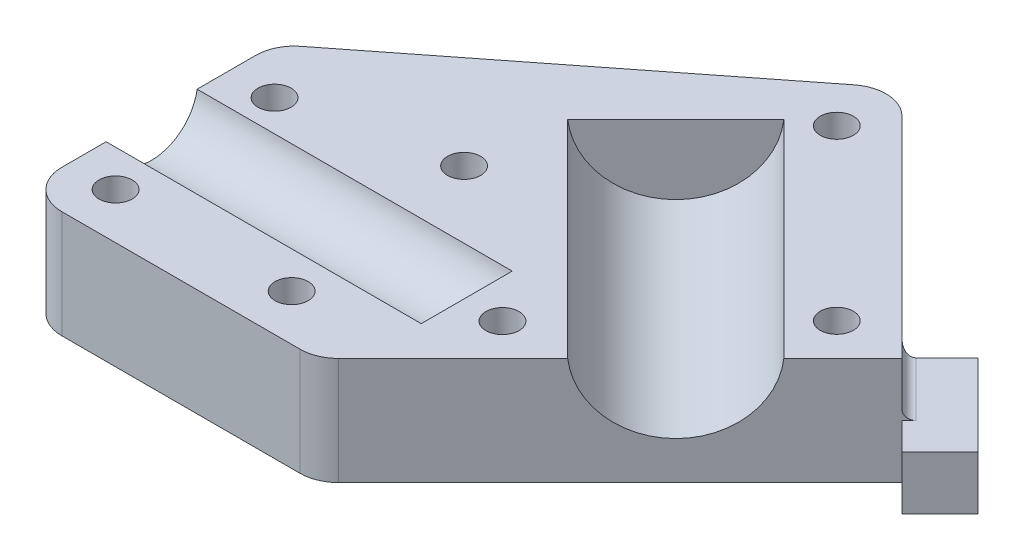
ISO-10303-21;
HEADER;
FILE_DESCRIPTION(('STEP AP214'),'2;1');
FILE_NAME('part.step','',(''),(''),'','','');
FILE_SCHEMA(('AUTOMOTIVE_DESIGN { 1 0 10303 214 1 1 1 1 }'));
ENDSEC;
DATA;
#1=APPLICATION_CONTEXT('core data for automotive mechanical design processes');
#2=APPLICATION_PROTOCOL_DEFINITION('international standard','automotive_design',2000,#1);
#3=PRODUCT_CONTEXT('',#1,'mechanical');
#4=PRODUCT('Part','Part','',(#3));
#5=PRODUCT_RELATED_PRODUCT_CATEGORY('part','',(#4));
#6=PRODUCT_DEFINITION_FORMATION('','',#4);
#7=PRODUCT_DEFINITION_CONTEXT('part definition',#1,'design');
#8=PRODUCT_DEFINITION('design','',#6,#7);
#9=PRODUCT_DEFINITION_SHAPE('','',#8);
#10=(LENGTH_UNIT() NAMED_UNIT(*) SI_UNIT(.MILLI.,.METRE.));
#11=(NAMED_UNIT(*) PLANE_ANGLE_UNIT() SI_UNIT($,.RADIAN.));
#12=(NAMED_UNIT(*) SI_UNIT($,.STERADIAN.) SOLID_ANGLE_UNIT());
#13=UNCERTAINTY_MEASURE_WITH_UNIT(LENGTH_MEASURE(1.E-05),#10,'distance_accuracy_value','');
#14=(GEOMETRIC_REPRESENTATION_CONTEXT(3) GLOBAL_UNCERTAINTY_ASSIGNED_CONTEXT((#13)) GLOBAL_UNIT_ASSIGNED_CONTEXT((#10,
#11,#12)) REPRESENTATION_CONTEXT('',''));
#15=CARTESIAN_POINT('',(0.,0.,0.));
#16=DIRECTION('',(0.,0.,1.));
#17=DIRECTION('',(1.,0.,0.));
#18=AXIS2_PLACEMENT_3D('',#15,#16,#17);
#19=CARTESIAN_POINT('',(-41.0289321881345,-1.,-16.3499999999999));
#20=DIRECTION('',(-0.617406762156341,0.,-0.78664406820596));
#21=DIRECTION('',(-0.78664406820596,0.,0.617406762156341));
#22=AXIS2_PLACEMENT_3D('',#19,#20,#21);
#23=PLANE('',#22);
#24=DIRECTION('',(0.78664406820596,0.,-0.617406762156341));
#25=VECTOR('',#24,1.);
#26=CARTESIAN_POINT('',(-41.0289321881345,-15.,-16.3499999999999));
#27=LINE('',#26,#25);
#28=CARTESIAN_POINT('',(-39.1159659989162,-15.,-17.8514138016617));
#29=VERTEX_POINT('',#28);
#30=CARTESIAN_POINT('',(1.25585463277242,-15.,-49.5377075983135));
#31=VERTEX_POINT('',#30);
#32=EDGE_CURVE('E264',#29,#31,#27,.T.);
#33=ORIENTED_EDGE('',*,*,#32,.F.);
#34=DIRECTION('',(0.,-1.,0.));
#35=VECTOR('',#34,1.);
#36=CARTESIAN_POINT('',(-39.1159659989162,-1.,-17.8514138016617));
#37=LINE('',#36,#35);
#38=CARTESIAN_POINT('',(-39.1159659989162,-1.,-17.8514138016617));
#39=VERTEX_POINT('',#38);
#40=EDGE_CURVE('E351',#29,#39,#37,.F.);
#41=ORIENTED_EDGE('',*,*,#40,.T.);
#42=DIRECTION('',(0.78664406820596,0.,-0.617406762156341));
#43=VECTOR('',#42,1.);
#44=CARTESIAN_POINT('',(-41.0289321881345,-1.,-16.3499999999999));
#45=LINE('',#44,#43);
#46=CARTESIAN_POINT('',(1.25585463277242,-1.,-49.5377075983135));
#47=VERTEX_POINT('',#46);
#48=EDGE_CURVE('E265',#39,#47,#45,.T.);
#49=ORIENTED_EDGE('',*,*,#48,.T.);
#50=DIRECTION('',(0.,-1.,0.));
#51=VECTOR('',#50,1.);
#52=CARTESIAN_POINT('',(1.25585463277243,-1.,-49.5377075983135));
#53=LINE('',#52,#51);
#54=EDGE_CURVE('E347',#47,#31,#53,.T.);
#55=ORIENTED_EDGE('',*,*,#54,.T.);
#56=EDGE_LOOP('',(#33,#41,#49,#55));
#57=FACE_BOUND('',#56,.T.);
#58=ADVANCED_FACE('F39',(#57),#23,.T.);
#59=CARTESIAN_POINT('',(-41.0289321881345,-1.,16.35));
#60=DIRECTION('',(-1.,0.,0.));
#61=DIRECTION('',(0.,0.,1.));
#62=AXIS2_PLACEMENT_3D('',#59,#60,#61);
#63=PLANE('',#62);
#64=DIRECTION('',(0.,0.,-1.));
#65=VECTOR('',#64,1.);
#66=CARTESIAN_POINT('',(-41.0289321881345,-15.,16.35));
#67=LINE('',#66,#65);
#68=CARTESIAN_POINT('',(-41.0289321881345,-15.,11.35));
#69=VERTEX_POINT('',#68);
#70=CARTESIAN_POINT('',(-41.0289321881345,-15.,-13.9181934606319));
#71=VERTEX_POINT('',#70);
#72=EDGE_CURVE('E270',#69,#71,#67,.T.);
#73=ORIENTED_EDGE('',*,*,#72,.F.);
#74=DIRECTION('',(0.,-1.,0.));
#75=VECTOR('',#74,1.);
#76=CARTESIAN_POINT('',(-41.0289321881345,-1.,11.35));
#77=LINE('',#76,#75);
#78=CARTESIAN_POINT('',(-41.0289321881345,-1.,11.35));
#79=VERTEX_POINT('',#78);
#80=EDGE_CURVE('E328',#69,#79,#77,.F.);
#81=ORIENTED_EDGE('',*,*,#80,.T.);
#82=DIRECTION('',(0.,0.,-1.));
#83=VECTOR('',#82,1.);
#84=CARTESIAN_POINT('',(-41.0289321881345,-1.,16.35));
#85=LINE('',#84,#83);
#86=CARTESIAN_POINT('',(-41.0289321881345,-0.999999999999999,5.57950001493335));
#87=VERTEX_POINT('',#86);
#88=EDGE_CURVE('E282',#79,#87,#85,.T.);
#89=ORIENTED_EDGE('',*,*,#88,.T.);
#90=CARTESIAN_POINT('',(-41.0289321881345,-0.0551181102362147,-0.345632744287866));
#91=DIRECTION('',(-1.,0.,0.));
#92=DIRECTION('',(0.,0.,1.));
#93=AXIS2_PLACEMENT_3D('',#90,#91,#92);
#94=CIRCLE('',#93,6.);
#95=CARTESIAN_POINT('',(-41.0289321881345,-1.,-6.27076550350908));
#96=VERTEX_POINT('',#95);
#97=EDGE_CURVE('E197',#96,#87,#94,.T.);
#98=ORIENTED_EDGE('',*,*,#97,.F.);
#99=CARTESIAN_POINT('',(-41.0289321881345,-1.,-13.9181934606319));
#100=VERTEX_POINT('',#99);
#101=EDGE_CURVE('E281',#96,#100,#85,.T.);
#102=ORIENTED_EDGE('',*,*,#101,.T.);
#103=DIRECTION('',(0.,-1.,0.));
#104=VECTOR('',#103,1.);
#105=CARTESIAN_POINT('',(-41.0289321881345,-1.,-13.9181934606319));
#106=LINE('',#105,#104);
#107=EDGE_CURVE('E324',#100,#71,#106,.T.);
#108=ORIENTED_EDGE('',*,*,#107,.T.);
#109=EDGE_LOOP('',(#73,#81,#89,#98,#102,#108));
#110=FACE_BOUND('',#109,.T.);
#111=ADVANCED_FACE('F398',(#110),#63,.T.);
#112=CARTESIAN_POINT('',(-2.92893218813456,-1.,16.35));
#113=DIRECTION('',(0.,0.,1.));
#114=DIRECTION('',(1.,0.,0.));
#115=AXIS2_PLACEMENT_3D('',#112,#113,#114);
#116=PLANE('',#115);
#117=DIRECTION('',(-1.,0.,0.));
#118=VECTOR('',#117,1.);
#119=CARTESIAN_POINT('',(-2.92893218813456,-1.,16.35));
#120=LINE('',#119,#118);
#121=CARTESIAN_POINT('',(-5.00000000000003,-1.,16.35));
#122=VERTEX_POINT('',#121);
#123=CARTESIAN_POINT('',(-36.0289321881345,-1.,16.35));
#124=VERTEX_POINT('',#123);
#125=EDGE_CURVE('E277',#122,#124,#120,.T.);
#126=ORIENTED_EDGE('',*,*,#125,.T.);
#127=DIRECTION('',(0.,-1.,0.));
#128=VECTOR('',#127,1.);
#129=CARTESIAN_POINT('',(-36.0289321881345,-1.,16.35));
#130=LINE('',#129,#128);
#131=CARTESIAN_POINT('',(-36.0289321881345,-15.,16.35));
#132=VERTEX_POINT('',#131);
#133=EDGE_CURVE('E308',#124,#132,#130,.T.);
#134=ORIENTED_EDGE('',*,*,#133,.T.);
#135=DIRECTION('',(-1.,0.,0.));
#136=VECTOR('',#135,1.);
#137=CARTESIAN_POINT('',(-2.92893218813456,-15.,16.35));
#138=LINE('',#137,#136);
#139=CARTESIAN_POINT('',(-5.00000000000003,-15.,16.35));
#140=VERTEX_POINT('',#139);
#141=EDGE_CURVE('E296',#140,#132,#138,.T.);
#142=ORIENTED_EDGE('',*,*,#141,.F.);
#143=DIRECTION('',(0.,-1.,0.));
#144=VECTOR('',#143,1.);
#145=CARTESIAN_POINT('',(-5.00000000000003,-1.,16.35));
#146=LINE('',#145,#144);
#147=EDGE_CURVE('E305',#140,#122,#146,.F.);
#148=ORIENTED_EDGE('',*,*,#147,.T.);
#149=EDGE_LOOP('',(#126,#134,#142,#148));
#150=FACE_BOUND('',#149,.T.);
#151=ADVANCED_FACE('F389',(#150),#116,.T.);
#152=CARTESIAN_POINT('',(35.2197556622844,-1.,-21.7986878504189));
#153=DIRECTION('',(0.707106781186547,0.,0.707106781186548));
#154=DIRECTION('',(0.707106781186548,0.,-0.707106781186547));
#155=AXIS2_PLACEMENT_3D('',#152,#153,#154);
#156=PLANE('',#155);
#157=DIRECTION('',(-0.707106781186548,0.,0.707106781186547));
#158=VECTOR('',#157,1.);
#159=CARTESIAN_POINT('',(35.2197556622844,-1.,-21.7986878504189));
#160=LINE('',#159,#158);
#161=CARTESIAN_POINT('',(13.4550962518592,-1.,-0.0340284399936866));
#162=VERTEX_POINT('',#161);
#163=CARTESIAN_POINT('',(-1.46446609406729,-1.,14.8855339059327));
#164=VERTEX_POINT('',#163);
#165=EDGE_CURVE('E195',#162,#164,#160,.T.);
#166=ORIENTED_EDGE('',*,*,#165,.T.);
#167=DIRECTION('',(0.,-1.,0.));
#168=VECTOR('',#167,1.);
#169=CARTESIAN_POINT('',(-1.46446609406729,-1.,14.8855339059327));
#170=LINE('',#169,#168);
#171=CARTESIAN_POINT('',(-1.46446609406729,-15.,14.8855339059327));
#172=VERTEX_POINT('',#171);
#173=EDGE_CURVE('E343',#164,#172,#170,.T.);
#174=ORIENTED_EDGE('',*,*,#173,.T.);
#175=DIRECTION('',(-0.707106781186548,0.,0.707106781186547));
#176=VECTOR('',#175,1.);
#177=CARTESIAN_POINT('',(35.2197556622844,-15.,-21.7986878504189));
#178=LINE('',#177,#176);
#179=CARTESIAN_POINT('',(35.2197556622844,-15.,-21.7986878504189));
#180=VERTEX_POINT('',#179);
#181=EDGE_CURVE('E292',#180,#172,#178,.T.);
#182=ORIENTED_EDGE('',*,*,#181,.F.);
#183=DIRECTION('',(0.,-1.,0.));
#184=VECTOR('',#183,1.);
#185=CARTESIAN_POINT('',(35.2197556622844,-1.,-21.7986878504189));
#186=LINE('',#185,#184);
#187=CARTESIAN_POINT('',(35.2197556622844,-8.,-21.7986878504189));
#188=VERTEX_POINT('',#187);
#189=EDGE_CURVE('E254',#188,#180,#186,.T.);
#190=ORIENTED_EDGE('',*,*,#189,.F.);
#191=DIRECTION('',(-0.707106781186548,0.,0.707106781186547));
#192=VECTOR('',#191,1.);
#193=CARTESIAN_POINT('',(6.71053390593273,-8.,6.71053390593273));
#194=LINE('',#193,#192);
#195=CARTESIAN_POINT('',(36.1177812743913,-8.,-22.6967134625258));
#196=VERTEX_POINT('',#195);
#197=EDGE_CURVE('E359',#196,#188,#194,.T.);
#198=ORIENTED_EDGE('',*,*,#197,.F.);
#199=CARTESIAN_POINT('',(36.1177812743913,-6.73,-22.6967134625258));
#200=DIRECTION('',(0.707106781186547,0.,0.707106781186548));
#201=DIRECTION('',(0.707106781186548,0.,-0.707106781186547));
#202=AXIS2_PLACEMENT_3D('',#199,#200,#201);
#203=CIRCLE('',#202,1.27);
#204=CARTESIAN_POINT('',(35.2197556622844,-6.73,-21.7986878504189));
#205=VERTEX_POINT('',#204);
#206=EDGE_CURVE('E366',#196,#205,#203,.F.);
#207=ORIENTED_EDGE('',*,*,#206,.T.);
#208=DIRECTION('',(0.,-1.,0.));
#209=VECTOR('',#208,1.);
#210=CARTESIAN_POINT('',(35.2197556622844,-1.,-21.7986878504189));
#211=LINE('',#210,#209);
#212=CARTESIAN_POINT('',(35.2197556622844,-1.,-21.7986878504189));
#213=VERTEX_POINT('',#212);
#214=EDGE_CURVE('E285',#213,#205,#211,.T.);
#215=ORIENTED_EDGE('',*,*,#214,.F.);
#216=CARTESIAN_POINT('',(27.531880540861,-1.00000000000003,-14.1108127289955));
#217=VERTEX_POINT('',#216);
#218=EDGE_CURVE('E273',#213,#217,#160,.T.);
#219=ORIENTED_EDGE('',*,*,#218,.T.);
#220=CARTESIAN_POINT('',(20.4934883963601,-0.0397541770693436,-7.07242058449459));
#221=DIRECTION('',(0.707106781186547,0.,0.707106781186548));
#222=DIRECTION('',(0.707106781186548,0.,-0.707106781186547));
#223=AXIS2_PLACEMENT_3D('',#220,#221,#222);
#224=CIRCLE('',#223,10.);
#225=EDGE_CURVE('E185',#162,#217,#224,.T.);
#226=ORIENTED_EDGE('',*,*,#225,.F.);
#227=EDGE_LOOP('',(#166,#174,#182,#190,#198,#207,#215,#219,#226));
#228=FACE_BOUND('',#227,.T.);
#229=ADVANCED_FACE('F380',(#228),#156,.T.);
#230=CARTESIAN_POINT('',(4.74345339314427,-1.,-52.2749901195591));
#231=DIRECTION('',(0.707106781186548,0.,-0.707106781186547));
#232=DIRECTION('',(-0.707106781186547,0.,-0.707106781186548));
#233=AXIS2_PLACEMENT_3D('',#230,#231,#232);
#234=PLANE('',#233);
#235=DIRECTION('',(-0.707106781186547,0.,-0.707106781186548));
#236=VECTOR('',#235,1.);
#237=CARTESIAN_POINT('',(4.74345339314427,-6.73,-52.2749901195591));
#238=LINE('',#237,#236);
#239=CARTESIAN_POINT('',(27.250662238312,-6.73,-29.7677812743913));
#240=VERTEX_POINT('',#239);
#241=EDGE_CURVE('E62',#205,#240,#238,.T.);
#242=ORIENTED_EDGE('',*,*,#241,.T.);
#243=DIRECTION('',(0.,-1.,0.));
#244=VECTOR('',#243,1.);
#245=CARTESIAN_POINT('',(27.250662238312,-15.,-29.7677812743913));
#246=LINE('',#245,#244);
#247=CARTESIAN_POINT('',(27.250662238312,-15.,-29.7677812743913));
#248=VERTEX_POINT('',#247);
#249=EDGE_CURVE('E369',#240,#248,#246,.T.);
#250=ORIENTED_EDGE('',*,*,#249,.T.);
#251=DIRECTION('',(0.707106781186547,0.,0.707106781186548));
#252=VECTOR('',#251,1.);
#253=CARTESIAN_POINT('',(4.74345339314427,-15.,-52.2749901195591));
#254=LINE('',#253,#252);
#255=CARTESIAN_POINT('',(7.87842234948687,-15.,-49.1400211632165));
#256=VERTEX_POINT('',#255);
#257=EDGE_CURVE('E289',#256,#248,#254,.T.);
#258=ORIENTED_EDGE('',*,*,#257,.F.);
#259=DIRECTION('',(0.,-1.,0.));
#260=VECTOR('',#259,1.);
#261=CARTESIAN_POINT('',(7.87842234948687,-1.,-49.1400211632165));
#262=LINE('',#261,#260);
#263=CARTESIAN_POINT('',(7.87842234948687,-1.,-49.1400211632165));
#264=VERTEX_POINT('',#263);
#265=EDGE_CURVE('E354',#256,#264,#262,.F.);
#266=ORIENTED_EDGE('',*,*,#265,.T.);
#267=DIRECTION('',(0.707106781186547,0.,0.707106781186548));
#268=VECTOR('',#267,1.);
#269=CARTESIAN_POINT('',(4.74345339314427,-1.,-52.2749901195591));
#270=LINE('',#269,#268);
#271=EDGE_CURVE('E269',#264,#213,#270,.T.);
#272=ORIENTED_EDGE('',*,*,#271,.T.);
#273=ORIENTED_EDGE('',*,*,#214,.T.);
#274=EDGE_LOOP('',(#242,#250,#258,#266,#272,#273));
#275=FACE_BOUND('',#274,.T.);
#276=ADVANCED_FACE('F415',(#275),#234,.T.);
#277=CARTESIAN_POINT('',(0.,-1.,0.));
#278=DIRECTION('',(0.,-1.,0.));
#279=DIRECTION('',(0.,0.,-1.));
#280=AXIS2_PLACEMENT_3D('',#277,#278,#279);
#281=PLANE('',#280);
#282=CARTESIAN_POINT('',(-35.0289321881345,-1.,10.35));
#283=DIRECTION('',(0.,-1.,0.));
#284=DIRECTION('',(0.,0.,-1.));
#285=AXIS2_PLACEMENT_3D('',#282,#283,#284);
#286=CIRCLE('',#285,2.15899999999999);
#287=CARTESIAN_POINT('',(-35.0289321881345,-1.,8.19100000000001));
#288=VERTEX_POINT('',#287);
#289=EDGE_CURVE('E755',#288,#288,#286,.T.);
#290=ORIENTED_EDGE('',*,*,#289,.T.);
#291=EDGE_LOOP('',(#290));
#292=FACE_BOUND('',#291,.T.);
#293=CARTESIAN_POINT('',(5.,-1.,0.));
#294=DIRECTION('',(0.,-1.,0.));
#295=DIRECTION('',(0.,0.,-1.));
#296=AXIS2_PLACEMENT_3D('',#293,#294,#295);
#297=CIRCLE('',#296,2.15899999999999);
#298=CARTESIAN_POINT('',(5.,-1.,-2.15899999999999));
#299=VERTEX_POINT('',#298);
#300=EDGE_CURVE('E747',#299,#299,#297,.T.);
#301=ORIENTED_EDGE('',*,*,#300,.T.);
#302=EDGE_LOOP('',(#301));
#303=FACE_BOUND('',#302,.T.);
#304=CARTESIAN_POINT('',(-15.,-1.,-15.));
#305=DIRECTION('',(0.,-1.,0.));
#306=DIRECTION('',(0.,0.,-1.));
#307=AXIS2_PLACEMENT_3D('',#304,#305,#306);
#308=CIRCLE('',#307,2.15899999999999);
#309=CARTESIAN_POINT('',(-15.,-1.,-17.159));
#310=VERTEX_POINT('',#309);
#311=EDGE_CURVE('E739',#310,#310,#308,.T.);
#312=ORIENTED_EDGE('',*,*,#311,.T.);
#313=EDGE_LOOP('',(#312));
#314=FACE_BOUND('',#313,.T.);
#315=CARTESIAN_POINT('',(-12.1030431086579,-1.,10.35));
#316=DIRECTION('',(0.,-1.,0.));
#317=DIRECTION('',(0.,0.,-1.));
#318=AXIS2_PLACEMENT_3D('',#315,#316,#317);
#319=CIRCLE('',#318,2.15899999999999);
#320=CARTESIAN_POINT('',(-12.1030431086579,-1.,8.19100000000001));
#321=VERTEX_POINT('',#320);
#322=EDGE_CURVE('E731',#321,#321,#319,.T.);
#323=ORIENTED_EDGE('',*,*,#322,.T.);
#324=EDGE_LOOP('',(#323));
#325=FACE_BOUND('',#324,.T.);
#326=CARTESIAN_POINT('',(-35.0289321881345,-1.,-10.35));
#327=DIRECTION('',(0.,-1.,0.));
#328=DIRECTION('',(0.,0.,-1.));
#329=AXIS2_PLACEMENT_3D('',#326,#327,#328);
#330=CIRCLE('',#329,2.15899999999999);
#331=CARTESIAN_POINT('',(-35.0289321881345,-1.,-12.509));
#332=VERTEX_POINT('',#331);
#333=EDGE_CURVE('E723',#332,#332,#330,.T.);
#334=ORIENTED_EDGE('',*,*,#333,.T.);
#335=EDGE_LOOP('',(#334));
#336=FACE_BOUND('',#335,.T.);
#337=CARTESIAN_POINT('',(4.74345339314418,-1.,-43.7897087453206));
#338=DIRECTION('',(0.,-1.,0.));
#339=DIRECTION('',(0.,0.,-1.));
#340=AXIS2_PLACEMENT_3D('',#337,#338,#339);
#341=CIRCLE('',#340,2.15899999999999);
#342=CARTESIAN_POINT('',(4.74345339314418,-1.,-45.9487087453206));
#343=VERTEX_POINT('',#342);
#344=EDGE_CURVE('E711',#343,#343,#341,.T.);
#345=ORIENTED_EDGE('',*,*,#344,.T.);
#346=EDGE_LOOP('',(#345));
#347=FACE_BOUND('',#346,.T.);
#348=CARTESIAN_POINT('',(26.7344742880458,-1.,-21.7986878504189));
#349=DIRECTION('',(0.,-1.,0.));
#350=DIRECTION('',(0.,0.,-1.));
#351=AXIS2_PLACEMENT_3D('',#348,#349,#350);
#352=CIRCLE('',#351,2.15899999999998);
#353=CARTESIAN_POINT('',(26.7344742880458,-1.,-23.9576878504189));
#354=VERTEX_POINT('',#353);
#355=EDGE_CURVE('E705',#354,#354,#352,.T.);
#356=ORIENTED_EDGE('',*,*,#355,.T.);
#357=EDGE_LOOP('',(#356));
#358=FACE_BOUND('',#357,.T.);
#359=ORIENTED_EDGE('',*,*,#88,.F.);
#360=CARTESIAN_POINT('',(-36.0289321881345,-1.,11.35));
#361=DIRECTION('',(0.,-1.,0.));
#362=DIRECTION('',(0.,0.,-1.));
#363=AXIS2_PLACEMENT_3D('',#360,#361,#362);
#364=CIRCLE('',#363,5.);
#365=EDGE_CURVE('E340',#79,#124,#364,.F.);
#366=ORIENTED_EDGE('',*,*,#365,.T.);
#367=ORIENTED_EDGE('',*,*,#125,.F.);
#368=CARTESIAN_POINT('',(-5.00000000000002,-1.,11.35));
#369=DIRECTION('',(0.,-1.,0.));
#370=DIRECTION('',(0.,0.,-1.));
#371=AXIS2_PLACEMENT_3D('',#368,#369,#370);
#372=CIRCLE('',#371,5.);
#373=EDGE_CURVE('E337',#122,#164,#372,.F.);
#374=ORIENTED_EDGE('',*,*,#373,.T.);
#375=ORIENTED_EDGE('',*,*,#165,.F.);
#376=DIRECTION('',(0.707106781186547,0.,0.707106781186548));
#377=VECTOR('',#376,1.);
#378=CARTESIAN_POINT('',(-13.4856721113483,-1.,-26.9747968032011));
#379=LINE('',#378,#377);
#380=CARTESIAN_POINT('',(-13.4856721113483,-1.,-26.9747968032011));
#381=VERTEX_POINT('',#380);
#382=EDGE_CURVE('E177',#381,#162,#379,.T.);
#383=ORIENTED_EDGE('',*,*,#382,.F.);
#384=DIRECTION('',(-0.707106781186548,0.,0.707106781186547));
#385=VECTOR('',#384,1.);
#386=CARTESIAN_POINT('',(0.591112177653536,-1.00000000000003,-41.051581092203));
#387=LINE('',#386,#385);
#388=CARTESIAN_POINT('',(0.591112177653536,-1.,-41.051581092203));
#389=VERTEX_POINT('',#388);
#390=EDGE_CURVE('E184',#389,#381,#387,.T.);
#391=ORIENTED_EDGE('',*,*,#390,.F.);
#392=DIRECTION('',(0.707106781186547,0.,0.707106781186548));
#393=VECTOR('',#392,1.);
#394=CARTESIAN_POINT('',(0.591112177653536,-1.00000000000003,-41.051581092203));
#395=LINE('',#394,#393);
#396=EDGE_CURVE('E180',#389,#217,#395,.T.);
#397=ORIENTED_EDGE('',*,*,#396,.T.);
#398=ORIENTED_EDGE('',*,*,#218,.F.);
#399=ORIENTED_EDGE('',*,*,#271,.F.);
#400=CARTESIAN_POINT('',(4.34288844355413,-1.,-45.6044872572837));
#401=DIRECTION('',(0.,-1.,0.));
#402=DIRECTION('',(0.,0.,-1.));
#403=AXIS2_PLACEMENT_3D('',#400,#401,#402);
#404=CIRCLE('',#403,5.);
#405=EDGE_CURVE('E331',#264,#47,#404,.F.);
#406=ORIENTED_EDGE('',*,*,#405,.T.);
#407=ORIENTED_EDGE('',*,*,#48,.F.);
#408=CARTESIAN_POINT('',(-36.0289321881345,-1.,-13.9181934606319));
#409=DIRECTION('',(0.,-1.,0.));
#410=DIRECTION('',(0.,0.,-1.));
#411=AXIS2_PLACEMENT_3D('',#408,#409,#410);
#412=CIRCLE('',#411,5.);
#413=EDGE_CURVE('E334',#39,#100,#412,.F.);
#414=ORIENTED_EDGE('',*,*,#413,.T.);
#415=ORIENTED_EDGE('',*,*,#101,.F.);
#416=DIRECTION('',(-1.,0.,0.));
#417=VECTOR('',#416,1.);
#418=CARTESIAN_POINT('',(0.,-1.,-6.27076550350908));
#419=LINE('',#418,#417);
#420=CARTESIAN_POINT('',(0.,-1.,-6.27076550350908));
#421=VERTEX_POINT('',#420);
#422=EDGE_CURVE('E214',#421,#96,#419,.T.);
#423=ORIENTED_EDGE('',*,*,#422,.F.);
#424=DIRECTION('',(0.,0.,-1.));
#425=VECTOR('',#424,1.);
#426=CARTESIAN_POINT('',(0.,-0.999999999999999,5.57950001493335));
#427=LINE('',#426,#425);
#428=CARTESIAN_POINT('',(0.,-1.,5.57950001493335));
#429=VERTEX_POINT('',#428);
#430=EDGE_CURVE('E209',#429,#421,#427,.T.);
#431=ORIENTED_EDGE('',*,*,#430,.F.);
#432=DIRECTION('',(-1.,0.,0.));
#433=VECTOR('',#432,1.);
#434=CARTESIAN_POINT('',(0.,-0.999999999999999,5.57950001493335));
#435=LINE('',#434,#433);
#436=EDGE_CURVE('E212',#429,#87,#435,.T.);
#437=ORIENTED_EDGE('',*,*,#436,.T.);
#438=EDGE_LOOP('',(#359,#366,#367,#374,#375,#383,#391,#397,#398,#399,#406,#407,#414,#415,#423,
#431,#437));
#439=FACE_BOUND('',#438,.T.);
#440=ADVANCED_FACE('F193',(#292,#303,#314,#325,#336,#347,#358,#439),#281,.F.);
#441=CARTESIAN_POINT('',(0.,-15.,0.));
#442=DIRECTION('',(0.,-1.,0.));
#443=DIRECTION('',(0.,0.,-1.));
#444=AXIS2_PLACEMENT_3D('',#441,#442,#443);
#445=PLANE('',#444);
#446=CARTESIAN_POINT('',(-35.0289321881345,-15.,10.35));
#447=DIRECTION('',(0.,-1.,0.));
#448=DIRECTION('',(0.,0.,-1.));
#449=AXIS2_PLACEMENT_3D('',#446,#447,#448);
#450=CIRCLE('',#449,2.15899999999999);
#451=CARTESIAN_POINT('',(-35.0289321881345,-15.,8.19100000000001));
#452=VERTEX_POINT('',#451);
#453=EDGE_CURVE('E759',#452,#452,#450,.T.);
#454=ORIENTED_EDGE('',*,*,#453,.F.);
#455=EDGE_LOOP('',(#454));
#456=FACE_BOUND('',#455,.T.);
#457=CARTESIAN_POINT('',(5.,-15.,0.));
#458=DIRECTION('',(0.,-1.,0.));
#459=DIRECTION('',(0.,0.,-1.));
#460=AXIS2_PLACEMENT_3D('',#457,#458,#459);
#461=CIRCLE('',#460,2.15899999999999);
#462=CARTESIAN_POINT('',(5.,-15.,-2.15899999999999));
#463=VERTEX_POINT('',#462);
#464=EDGE_CURVE('E751',#463,#463,#461,.T.);
#465=ORIENTED_EDGE('',*,*,#464,.F.);
#466=EDGE_LOOP('',(#465));
#467=FACE_BOUND('',#466,.T.);
#468=CARTESIAN_POINT('',(-15.,-15.,-15.));
#469=DIRECTION('',(0.,-1.,0.));
#470=DIRECTION('',(0.,0.,-1.));
#471=AXIS2_PLACEMENT_3D('',#468,#469,#470);
#472=CIRCLE('',#471,2.15899999999999);
#473=CARTESIAN_POINT('',(-15.,-15.,-17.159));
#474=VERTEX_POINT('',#473);
#475=EDGE_CURVE('E743',#474,#474,#472,.T.);
#476=ORIENTED_EDGE('',*,*,#475,.F.);
#477=EDGE_LOOP('',(#476));
#478=FACE_BOUND('',#477,.T.);
#479=CARTESIAN_POINT('',(-12.1030431086579,-15.,10.35));
#480=DIRECTION('',(0.,-1.,0.));
#481=DIRECTION('',(0.,0.,-1.));
#482=AXIS2_PLACEMENT_3D('',#479,#480,#481);
#483=CIRCLE('',#482,2.15899999999999);
#484=CARTESIAN_POINT('',(-12.1030431086579,-15.,8.19100000000001));
#485=VERTEX_POINT('',#484);
#486=EDGE_CURVE('E735',#485,#485,#483,.T.);
#487=ORIENTED_EDGE('',*,*,#486,.F.);
#488=EDGE_LOOP('',(#487));
#489=FACE_BOUND('',#488,.T.);
#490=CARTESIAN_POINT('',(-35.0289321881345,-15.,-10.35));
#491=DIRECTION('',(0.,-1.,0.));
#492=DIRECTION('',(0.,0.,-1.));
#493=AXIS2_PLACEMENT_3D('',#490,#491,#492);
#494=CIRCLE('',#493,2.15899999999999);
#495=CARTESIAN_POINT('',(-35.0289321881345,-15.,-12.509));
#496=VERTEX_POINT('',#495);
#497=EDGE_CURVE('E727',#496,#496,#494,.T.);
#498=ORIENTED_EDGE('',*,*,#497,.F.);
#499=EDGE_LOOP('',(#498));
#500=FACE_BOUND('',#499,.T.);
#501=CARTESIAN_POINT('',(4.74345339314418,-15.,-43.7897087453206));
#502=DIRECTION('',(0.,-1.,0.));
#503=DIRECTION('',(0.,0.,-1.));
#504=AXIS2_PLACEMENT_3D('',#501,#502,#503);
#505=CIRCLE('',#504,2.15899999999999);
#506=CARTESIAN_POINT('',(4.74345339314418,-15.,-45.9487087453206));
#507=VERTEX_POINT('',#506);
#508=EDGE_CURVE('E717',#507,#507,#505,.T.);
#509=ORIENTED_EDGE('',*,*,#508,.F.);
#510=EDGE_LOOP('',(#509));
#511=FACE_BOUND('',#510,.T.);
#512=CARTESIAN_POINT('',(26.7344742880458,-15.,-21.7986878504189));
#513=DIRECTION('',(0.,-1.,0.));
#514=DIRECTION('',(0.,0.,-1.));
#515=AXIS2_PLACEMENT_3D('',#512,#513,#514);
#516=CIRCLE('',#515,2.15899999999999);
#517=CARTESIAN_POINT('',(26.7344742880458,-15.,-23.9576878504189));
#518=VERTEX_POINT('',#517);
#519=EDGE_CURVE('E708',#518,#518,#516,.T.);
#520=ORIENTED_EDGE('',*,*,#519,.F.);
#521=EDGE_LOOP('',(#520));
#522=FACE_BOUND('',#521,.T.);
#523=ORIENTED_EDGE('',*,*,#141,.T.);
#524=CARTESIAN_POINT('',(-36.0289321881345,-15.,11.35));
#525=DIRECTION('',(0.,-1.,0.));
#526=DIRECTION('',(0.,0.,-1.));
#527=AXIS2_PLACEMENT_3D('',#524,#525,#526);
#528=CIRCLE('',#527,5.);
#529=EDGE_CURVE('E321',#132,#69,#528,.T.);
#530=ORIENTED_EDGE('',*,*,#529,.T.);
#531=ORIENTED_EDGE('',*,*,#72,.T.);
#532=CARTESIAN_POINT('',(-36.0289321881345,-15.,-13.9181934606319));
#533=DIRECTION('',(0.,-1.,0.));
#534=DIRECTION('',(0.,0.,-1.));
#535=AXIS2_PLACEMENT_3D('',#532,#533,#534);
#536=CIRCLE('',#535,5.);
#537=EDGE_CURVE('E315',#71,#29,#536,.T.);
#538=ORIENTED_EDGE('',*,*,#537,.T.);
#539=ORIENTED_EDGE('',*,*,#32,.T.);
#540=CARTESIAN_POINT('',(4.34288844355413,-15.,-45.6044872572837));
#541=DIRECTION('',(0.,-1.,0.));
#542=DIRECTION('',(0.,0.,-1.));
#543=AXIS2_PLACEMENT_3D('',#540,#541,#542);
#544=CIRCLE('',#543,5.);
#545=EDGE_CURVE('E312',#31,#256,#544,.T.);
#546=ORIENTED_EDGE('',*,*,#545,.T.);
#547=ORIENTED_EDGE('',*,*,#257,.T.);
#548=CARTESIAN_POINT('',(28.148687850419,-15.,-30.6658068864982));
#549=DIRECTION('',(0.,-1.,0.));
#550=DIRECTION('',(0.,0.,-1.));
#551=AXIS2_PLACEMENT_3D('',#548,#549,#550);
#552=CIRCLE('',#551,1.27);
#553=CARTESIAN_POINT('',(29.0467134625259,-15.,-29.7677812743913));
#554=VERTEX_POINT('',#553);
#555=EDGE_CURVE('E48',#248,#554,#552,.F.);
#556=ORIENTED_EDGE('',*,*,#555,.T.);
#557=DIRECTION('',(0.707106781186548,0.,-0.707106781186548));
#558=VECTOR('',#557,1.);
#559=CARTESIAN_POINT('',(28.1486878504189,-15.,-28.8697556622843));
#560=LINE('',#559,#558);
#561=CARTESIAN_POINT('',(33.0984353187248,-15.,-33.8195031305902));
#562=VERTEX_POINT('',#561);
#563=EDGE_CURVE('E226',#554,#562,#560,.T.);
#564=ORIENTED_EDGE('',*,*,#563,.T.);
#565=DIRECTION('',(0.707106781186547,0.,0.707106781186548));
#566=VECTOR('',#565,1.);
#567=CARTESIAN_POINT('',(33.0984353187248,-15.,-33.8195031305902));
#568=LINE('',#567,#566);
#569=CARTESIAN_POINT('',(43.7050370365229,-15.,-23.2129014127921));
#570=VERTEX_POINT('',#569);
#571=EDGE_CURVE('E217',#562,#570,#568,.T.);
#572=ORIENTED_EDGE('',*,*,#571,.T.);
#573=DIRECTION('',(-0.707106781186547,0.,0.707106781186548));
#574=VECTOR('',#573,1.);
#575=CARTESIAN_POINT('',(43.7050370365229,-15.,-23.2129014127921));
#576=LINE('',#575,#574);
#577=CARTESIAN_POINT('',(38.755289568217,-15.,-18.2631539444862));
#578=VERTEX_POINT('',#577);
#579=EDGE_CURVE('E241',#570,#578,#576,.T.);
#580=ORIENTED_EDGE('',*,*,#579,.T.);
#581=DIRECTION('',(-0.707106781186548,0.,-0.707106781186547));
#582=VECTOR('',#581,1.);
#583=CARTESIAN_POINT('',(35.2197556622844,-15.,-21.7986878504189));
#584=LINE('',#583,#582);
#585=EDGE_CURVE('E245',#578,#180,#584,.T.);
#586=ORIENTED_EDGE('',*,*,#585,.T.);
#587=ORIENTED_EDGE('',*,*,#181,.T.);
#588=CARTESIAN_POINT('',(-5.00000000000002,-15.,11.35));
#589=DIRECTION('',(0.,-1.,0.));
#590=DIRECTION('',(0.,0.,-1.));
#591=AXIS2_PLACEMENT_3D('',#588,#589,#590);
#592=CIRCLE('',#591,5.);
#593=EDGE_CURVE('E318',#172,#140,#592,.T.);
#594=ORIENTED_EDGE('',*,*,#593,.T.);
#595=EDGE_LOOP('',(#523,#530,#531,#538,#539,#546,#547,#556,#564,#572,#580,#586,#587,#594));
#596=FACE_BOUND('',#595,.T.);
#597=ADVANCED_FACE('F387',(#456,#467,#478,#489,#500,#511,#522,#596),#445,.T.);
#598=CARTESIAN_POINT('',(33.0984353187248,-8.,-33.8195031305902));
#599=DIRECTION('',(0.707106781186548,0.,-0.707106781186547));
#600=DIRECTION('',(-0.707106781186547,0.,-0.707106781186548));
#601=AXIS2_PLACEMENT_3D('',#598,#599,#600);
#602=PLANE('',#601);
#603=ORIENTED_EDGE('',*,*,#571,.F.);
#604=DIRECTION('',(0.,-1.,0.));
#605=VECTOR('',#604,1.);
#606=CARTESIAN_POINT('',(33.0984353187248,-8.,-33.8195031305902));
#607=LINE('',#606,#605);
#608=CARTESIAN_POINT('',(33.0984353187248,-8.,-33.8195031305902));
#609=VERTEX_POINT('',#608);
#610=EDGE_CURVE('E250',#609,#562,#607,.T.);
#611=ORIENTED_EDGE('',*,*,#610,.F.);
#612=DIRECTION('',(0.707106781186547,0.,0.707106781186548));
#613=VECTOR('',#612,1.);
#614=CARTESIAN_POINT('',(33.0984353187248,-8.,-33.8195031305902));
#615=LINE('',#614,#613);
#616=CARTESIAN_POINT('',(43.7050370365229,-8.,-23.2129014127921));
#617=VERTEX_POINT('',#616);
#618=EDGE_CURVE('E221',#609,#617,#615,.T.);
#619=ORIENTED_EDGE('',*,*,#618,.T.);
#620=DIRECTION('',(0.,-1.,0.));
#621=VECTOR('',#620,1.);
#622=CARTESIAN_POINT('',(43.7050370365229,-8.,-23.2129014127921));
#623=LINE('',#622,#621);
#624=EDGE_CURVE('E237',#617,#570,#623,.T.);
#625=ORIENTED_EDGE('',*,*,#624,.T.);
#626=EDGE_LOOP('',(#603,#611,#619,#625));
#627=FACE_BOUND('',#626,.T.);
#628=ADVANCED_FACE('F501',(#627),#602,.T.);
#629=CARTESIAN_POINT('',(28.1486878504189,-8.,-28.8697556622843));
#630=DIRECTION('',(-0.707106781186548,0.,-0.707106781186548));
#631=DIRECTION('',(-0.707106781186548,0.,0.707106781186548));
#632=AXIS2_PLACEMENT_3D('',#629,#630,#631);
#633=PLANE('',#632);
#634=ORIENTED_EDGE('',*,*,#563,.F.);
#635=DIRECTION('',(0.,-1.,0.));
#636=VECTOR('',#635,1.);
#637=CARTESIAN_POINT('',(29.0467134625259,-6.73,-29.7677812743913));
#638=LINE('',#637,#636);
#639=CARTESIAN_POINT('',(29.0467134625259,-8.,-29.7677812743913));
#640=VERTEX_POINT('',#639);
#641=EDGE_CURVE('E372',#554,#640,#638,.F.);
#642=ORIENTED_EDGE('',*,*,#641,.T.);
#643=DIRECTION('',(0.707106781186548,0.,-0.707106781186548));
#644=VECTOR('',#643,1.);
#645=CARTESIAN_POINT('',(28.1486878504189,-8.,-28.8697556622843));
#646=LINE('',#645,#644);
#647=EDGE_CURVE('E234',#640,#609,#646,.T.);
#648=ORIENTED_EDGE('',*,*,#647,.T.);
#649=ORIENTED_EDGE('',*,*,#610,.T.);
#650=EDGE_LOOP('',(#634,#642,#648,#649));
#651=FACE_BOUND('',#650,.T.);
#652=ADVANCED_FACE('F423',(#651),#633,.T.);
#653=CARTESIAN_POINT('',(35.2197556622844,-8.,-21.7986878504189));
#654=DIRECTION('',(-0.707106781186547,0.,0.707106781186548));
#655=DIRECTION('',(0.707106781186548,0.,0.707106781186547));
#656=AXIS2_PLACEMENT_3D('',#653,#654,#655);
#657=PLANE('',#656);
#658=DIRECTION('',(-0.707106781186537,0.,-0.707106781186558));
#659=VECTOR('',#658,1.);
#660=CARTESIAN_POINT('',(38.755289568217,-8.,-18.2631539444862));
#661=LINE('',#660,#659);
#662=CARTESIAN_POINT('',(38.755289568217,-8.,-18.2631539444862));
#663=VERTEX_POINT('',#662);
#664=EDGE_CURVE('E230',#663,#188,#661,.T.);
#665=ORIENTED_EDGE('',*,*,#664,.T.);
#666=ORIENTED_EDGE('',*,*,#189,.T.);
#667=ORIENTED_EDGE('',*,*,#585,.F.);
#668=DIRECTION('',(0.,-1.,0.));
#669=VECTOR('',#668,1.);
#670=CARTESIAN_POINT('',(38.755289568217,-8.,-18.2631539444862));
#671=LINE('',#670,#669);
#672=EDGE_CURVE('E255',#663,#578,#671,.T.);
#673=ORIENTED_EDGE('',*,*,#672,.F.);
#674=EDGE_LOOP('',(#665,#666,#667,#673));
#675=FACE_BOUND('',#674,.T.);
#676=ADVANCED_FACE('F500',(#675),#657,.T.);
#677=CARTESIAN_POINT('',(43.7050370365229,-8.,-23.2129014127921));
#678=DIRECTION('',(0.707106781186548,0.,0.707106781186547));
#679=DIRECTION('',(0.707106781186547,0.,-0.707106781186548));
#680=AXIS2_PLACEMENT_3D('',#677,#678,#679);
#681=PLANE('',#680);
#682=ORIENTED_EDGE('',*,*,#579,.F.);
#683=ORIENTED_EDGE('',*,*,#624,.F.);
#684=DIRECTION('',(-0.707106781186547,0.,0.707106781186548));
#685=VECTOR('',#684,1.);
#686=CARTESIAN_POINT('',(43.7050370365229,-8.,-23.2129014127921));
#687=LINE('',#686,#685);
#688=EDGE_CURVE('E225',#617,#663,#687,.T.);
#689=ORIENTED_EDGE('',*,*,#688,.T.);
#690=ORIENTED_EDGE('',*,*,#672,.T.);
#691=EDGE_LOOP('',(#682,#683,#689,#690));
#692=FACE_BOUND('',#691,.T.);
#693=ADVANCED_FACE('F488',(#692),#681,.T.);
#694=CARTESIAN_POINT('',(0.,-8.,0.));
#695=DIRECTION('',(0.,-1.,0.));
#696=DIRECTION('',(0.,0.,-1.));
#697=AXIS2_PLACEMENT_3D('',#694,#695,#696);
#698=PLANE('',#697);
#699=ORIENTED_EDGE('',*,*,#647,.F.);
#700=DIRECTION('',(-0.707106781186547,0.,-0.707106781186548));
#701=VECTOR('',#700,1.);
#702=CARTESIAN_POINT('',(29.4072473684586,-8.,-29.4072473684586));
#703=LINE('',#702,#701);
#704=EDGE_CURVE('E362',#640,#196,#703,.F.);
#705=ORIENTED_EDGE('',*,*,#704,.T.);
#706=ORIENTED_EDGE('',*,*,#197,.T.);
#707=ORIENTED_EDGE('',*,*,#664,.F.);
#708=ORIENTED_EDGE('',*,*,#688,.F.);
#709=ORIENTED_EDGE('',*,*,#618,.F.);
#710=EDGE_LOOP('',(#699,#705,#706,#707,#708,#709));
#711=FACE_BOUND('',#710,.T.);
#712=ADVANCED_FACE('F428',(#711),#698,.F.);
#713=CARTESIAN_POINT('',(0.,-0.0551181102362147,-0.345632744287866));
#714=DIRECTION('',(-1.,0.,0.));
#715=DIRECTION('',(0.,0.,1.));
#716=AXIS2_PLACEMENT_3D('',#713,#714,#715);
#717=CYLINDRICAL_SURFACE('',#716,6.);
#718=ORIENTED_EDGE('',*,*,#97,.T.);
#719=ORIENTED_EDGE('',*,*,#436,.F.);
#720=CARTESIAN_POINT('',(0.,-0.0551181102362147,-0.345632744287866));
#721=DIRECTION('',(-1.,0.,0.));
#722=DIRECTION('',(0.,0.,1.));
#723=AXIS2_PLACEMENT_3D('',#720,#721,#722);
#724=CIRCLE('',#723,6.);
#725=EDGE_CURVE('E202',#421,#429,#724,.T.);
#726=ORIENTED_EDGE('',*,*,#725,.F.);
#727=ORIENTED_EDGE('',*,*,#422,.T.);
#728=EDGE_LOOP('',(#718,#719,#726,#727));
#729=FACE_BOUND('',#728,.T.);
#730=ADVANCED_FACE('F439',(#729),#717,.F.);
#731=CARTESIAN_POINT('',(0.,-0.0551181102362147,-0.345632744287866));
#732=DIRECTION('',(-1.,0.,0.));
#733=DIRECTION('',(0.,0.,1.));
#734=AXIS2_PLACEMENT_3D('',#731,#732,#733);
#735=PLANE('',#734);
#736=ORIENTED_EDGE('',*,*,#725,.T.);
#737=ORIENTED_EDGE('',*,*,#430,.T.);
#738=EDGE_LOOP('',(#736,#737));
#739=FACE_BOUND('',#738,.T.);
#740=ADVANCED_FACE('F442',(#739),#735,.T.);
#741=CARTESIAN_POINT('',(-6.44727996684738,-0.0397541770693436,-34.013188947702));
#742=DIRECTION('',(0.707106781186547,0.,0.707106781186548));
#743=DIRECTION('',(0.707106781186548,0.,-0.707106781186547));
#744=AXIS2_PLACEMENT_3D('',#741,#742,#743);
#745=CYLINDRICAL_SURFACE('',#744,10.);
#746=ORIENTED_EDGE('',*,*,#225,.T.);
#747=ORIENTED_EDGE('',*,*,#396,.F.);
#748=CARTESIAN_POINT('',(-6.44727996684738,-0.0397541770693436,-34.013188947702));
#749=DIRECTION('',(0.707106781186547,0.,0.707106781186548));
#750=DIRECTION('',(0.707106781186548,0.,-0.707106781186547));
#751=AXIS2_PLACEMENT_3D('',#748,#749,#750);
#752=CIRCLE('',#751,10.);
#753=EDGE_CURVE('E173',#381,#389,#752,.T.);
#754=ORIENTED_EDGE('',*,*,#753,.F.);
#755=ORIENTED_EDGE('',*,*,#382,.T.);
#756=EDGE_LOOP('',(#746,#747,#754,#755));
#757=FACE_BOUND('',#756,.T.);
#758=ADVANCED_FACE('F175',(#757),#745,.F.);
#759=CARTESIAN_POINT('',(-6.44727996684738,-0.0397541770693436,-34.013188947702));
#760=DIRECTION('',(0.707106781186547,0.,0.707106781186548));
#761=DIRECTION('',(0.707106781186548,0.,-0.707106781186547));
#762=AXIS2_PLACEMENT_3D('',#759,#760,#761);
#763=PLANE('',#762);
#764=ORIENTED_EDGE('',*,*,#753,.T.);
#765=ORIENTED_EDGE('',*,*,#390,.T.);
#766=EDGE_LOOP('',(#764,#765));
#767=FACE_BOUND('',#766,.T.);
#768=ADVANCED_FACE('F187',(#767),#763,.T.);
#769=CARTESIAN_POINT('',(26.7344742880458,-15.,-21.7986878504189));
#770=DIRECTION('',(0.,-1.,0.));
#771=DIRECTION('',(0.,0.,-1.));
#772=AXIS2_PLACEMENT_3D('',#769,#770,#771);
#773=CYLINDRICAL_SURFACE('',#772,2.15899999999999);
#774=ORIENTED_EDGE('',*,*,#355,.F.);
#775=EDGE_LOOP('',(#774));
#776=FACE_BOUND('',#775,.T.);
#777=ORIENTED_EDGE('',*,*,#519,.T.);
#778=EDGE_LOOP('',(#777));
#779=FACE_BOUND('',#778,.T.);
#780=ADVANCED_FACE('F638',(#776,#779),#773,.F.);
#781=CARTESIAN_POINT('',(4.74345339314418,-15.,-43.7897087453206));
#782=DIRECTION('',(0.,-1.,0.));
#783=DIRECTION('',(0.,0.,-1.));
#784=AXIS2_PLACEMENT_3D('',#781,#782,#783);
#785=CYLINDRICAL_SURFACE('',#784,2.15899999999999);
#786=ORIENTED_EDGE('',*,*,#344,.F.);
#787=EDGE_LOOP('',(#786));
#788=FACE_BOUND('',#787,.T.);
#789=ORIENTED_EDGE('',*,*,#508,.T.);
#790=EDGE_LOOP('',(#789));
#791=FACE_BOUND('',#790,.T.);
#792=ADVANCED_FACE('F628',(#788,#791),#785,.F.);
#793=CARTESIAN_POINT('',(-35.0289321881345,-15.,-10.35));
#794=DIRECTION('',(0.,-1.,0.));
#795=DIRECTION('',(0.,0.,-1.));
#796=AXIS2_PLACEMENT_3D('',#793,#794,#795);
#797=CYLINDRICAL_SURFACE('',#796,2.15899999999999);
#798=ORIENTED_EDGE('',*,*,#333,.F.);
#799=EDGE_LOOP('',(#798));
#800=FACE_BOUND('',#799,.T.);
#801=ORIENTED_EDGE('',*,*,#497,.T.);
#802=EDGE_LOOP('',(#801));
#803=FACE_BOUND('',#802,.T.);
#804=ADVANCED_FACE('F618',(#800,#803),#797,.F.);
#805=CARTESIAN_POINT('',(-12.1030431086579,-15.,10.35));
#806=DIRECTION('',(0.,-1.,0.));
#807=DIRECTION('',(0.,0.,-1.));
#808=AXIS2_PLACEMENT_3D('',#805,#806,#807);
#809=CYLINDRICAL_SURFACE('',#808,2.15899999999999);
#810=ORIENTED_EDGE('',*,*,#322,.F.);
#811=EDGE_LOOP('',(#810));
#812=FACE_BOUND('',#811,.T.);
#813=ORIENTED_EDGE('',*,*,#486,.T.);
#814=EDGE_LOOP('',(#813));
#815=FACE_BOUND('',#814,.T.);
#816=ADVANCED_FACE('F608',(#812,#815),#809,.F.);
#817=CARTESIAN_POINT('',(-15.,-15.,-15.));
#818=DIRECTION('',(0.,-1.,0.));
#819=DIRECTION('',(0.,0.,-1.));
#820=AXIS2_PLACEMENT_3D('',#817,#818,#819);
#821=CYLINDRICAL_SURFACE('',#820,2.15899999999999);
#822=ORIENTED_EDGE('',*,*,#311,.F.);
#823=EDGE_LOOP('',(#822));
#824=FACE_BOUND('',#823,.T.);
#825=ORIENTED_EDGE('',*,*,#475,.T.);
#826=EDGE_LOOP('',(#825));
#827=FACE_BOUND('',#826,.T.);
#828=ADVANCED_FACE('F598',(#824,#827),#821,.F.);
#829=CARTESIAN_POINT('',(5.,-15.,0.));
#830=DIRECTION('',(0.,-1.,0.));
#831=DIRECTION('',(0.,0.,-1.));
#832=AXIS2_PLACEMENT_3D('',#829,#830,#831);
#833=CYLINDRICAL_SURFACE('',#832,2.15899999999999);
#834=ORIENTED_EDGE('',*,*,#300,.F.);
#835=EDGE_LOOP('',(#834));
#836=FACE_BOUND('',#835,.T.);
#837=ORIENTED_EDGE('',*,*,#464,.T.);
#838=EDGE_LOOP('',(#837));
#839=FACE_BOUND('',#838,.T.);
#840=ADVANCED_FACE('F588',(#836,#839),#833,.F.);
#841=CARTESIAN_POINT('',(-35.0289321881345,-15.,10.35));
#842=DIRECTION('',(0.,-1.,0.));
#843=DIRECTION('',(0.,0.,-1.));
#844=AXIS2_PLACEMENT_3D('',#841,#842,#843);
#845=CYLINDRICAL_SURFACE('',#844,2.15899999999999);
#846=ORIENTED_EDGE('',*,*,#289,.F.);
#847=EDGE_LOOP('',(#846));
#848=FACE_BOUND('',#847,.T.);
#849=ORIENTED_EDGE('',*,*,#453,.T.);
#850=EDGE_LOOP('',(#849));
#851=FACE_BOUND('',#850,.T.);
#852=ADVANCED_FACE('F462',(#848,#851),#845,.F.);
#853=CARTESIAN_POINT('',(-36.0289321881345,-1.,11.35));
#854=DIRECTION('',(0.,-1.,0.));
#855=DIRECTION('',(0.,0.,-1.));
#856=AXIS2_PLACEMENT_3D('',#853,#854,#855);
#857=CYLINDRICAL_SURFACE('',#856,5.);
#858=ORIENTED_EDGE('',*,*,#365,.F.);
#859=ORIENTED_EDGE('',*,*,#80,.F.);
#860=ORIENTED_EDGE('',*,*,#529,.F.);
#861=ORIENTED_EDGE('',*,*,#133,.F.);
#862=EDGE_LOOP('',(#858,#859,#860,#861));
#863=FACE_BOUND('',#862,.T.);
#864=ADVANCED_FACE('F394',(#863),#857,.T.);
#865=CARTESIAN_POINT('',(-5.00000000000002,-1.,11.35));
#866=DIRECTION('',(0.,-1.,0.));
#867=DIRECTION('',(0.,0.,-1.));
#868=AXIS2_PLACEMENT_3D('',#865,#866,#867);
#869=CYLINDRICAL_SURFACE('',#868,5.);
#870=ORIENTED_EDGE('',*,*,#373,.F.);
#871=ORIENTED_EDGE('',*,*,#147,.F.);
#872=ORIENTED_EDGE('',*,*,#593,.F.);
#873=ORIENTED_EDGE('',*,*,#173,.F.);
#874=EDGE_LOOP('',(#870,#871,#872,#873));
#875=FACE_BOUND('',#874,.T.);
#876=ADVANCED_FACE('F384',(#875),#869,.T.);
#877=CARTESIAN_POINT('',(-36.0289321881345,-1.,-13.9181934606319));
#878=DIRECTION('',(0.,-1.,0.));
#879=DIRECTION('',(0.,0.,-1.));
#880=AXIS2_PLACEMENT_3D('',#877,#878,#879);
#881=CYLINDRICAL_SURFACE('',#880,5.);
#882=ORIENTED_EDGE('',*,*,#413,.F.);
#883=ORIENTED_EDGE('',*,*,#40,.F.);
#884=ORIENTED_EDGE('',*,*,#537,.F.);
#885=ORIENTED_EDGE('',*,*,#107,.F.);
#886=EDGE_LOOP('',(#882,#883,#884,#885));
#887=FACE_BOUND('',#886,.T.);
#888=ADVANCED_FACE('F404',(#887),#881,.T.);
#889=CARTESIAN_POINT('',(4.34288844355413,-1.,-45.6044872572837));
#890=DIRECTION('',(0.,-1.,0.));
#891=DIRECTION('',(0.,0.,-1.));
#892=AXIS2_PLACEMENT_3D('',#889,#890,#891);
#893=CYLINDRICAL_SURFACE('',#892,5.);
#894=ORIENTED_EDGE('',*,*,#405,.F.);
#895=ORIENTED_EDGE('',*,*,#265,.F.);
#896=ORIENTED_EDGE('',*,*,#545,.F.);
#897=ORIENTED_EDGE('',*,*,#54,.F.);
#898=EDGE_LOOP('',(#894,#895,#896,#897));
#899=FACE_BOUND('',#898,.T.);
#900=ADVANCED_FACE('F412',(#899),#893,.T.);
#901=CARTESIAN_POINT('',(5.64147900525119,-6.73,-53.173015731666));
#902=DIRECTION('',(-0.707106781186547,0.,-0.707106781186548));
#903=DIRECTION('',(-0.707106781186548,0.,0.707106781186547));
#904=AXIS2_PLACEMENT_3D('',#901,#902,#903);
#905=CYLINDRICAL_SURFACE('',#904,1.27);
#906=ORIENTED_EDGE('',*,*,#206,.F.);
#907=ORIENTED_EDGE('',*,*,#704,.F.);
#908=CARTESIAN_POINT('',(28.148687850419,-6.73,-30.6658068864982));
#909=DIRECTION('',(-0.5,-0.707106781186547,-0.5));
#910=DIRECTION('',(-0.5,0.707106781186547,-0.5));
#911=AXIS2_PLACEMENT_3D('',#908,#909,#910);
#912=ELLIPSE('',#911,1.79605122421383,1.27);
#913=EDGE_CURVE('E11',#640,#240,#912,.T.);
#914=ORIENTED_EDGE('',*,*,#913,.T.);
#915=ORIENTED_EDGE('',*,*,#241,.F.);
#916=EDGE_LOOP('',(#906,#907,#914,#915));
#917=FACE_BOUND('',#916,.T.);
#918=ADVANCED_FACE('F432',(#917),#905,.F.);
#919=CARTESIAN_POINT('',(28.148687850419,-1.,-30.6658068864982));
#920=DIRECTION('',(0.,1.,0.));
#921=DIRECTION('',(0.,0.,1.));
#922=AXIS2_PLACEMENT_3D('',#919,#920,#921);
#923=CYLINDRICAL_SURFACE('',#922,1.27);
#924=ORIENTED_EDGE('',*,*,#913,.F.);
#925=ORIENTED_EDGE('',*,*,#641,.F.);
#926=ORIENTED_EDGE('',*,*,#555,.F.);
#927=ORIENTED_EDGE('',*,*,#249,.F.);
#928=EDGE_LOOP('',(#924,#925,#926,#927));
#929=FACE_BOUND('',#928,.T.);
#930=ADVANCED_FACE('F41',(#929),#923,.F.);
#931=CLOSED_SHELL('',(#58,#111,#151,#229,#276,#440,#597,#628,#652,#676,#693,#712,#730,#740,#758,
#768,#780,#792,#804,#816,#828,#840,#852,#864,#876,#888,#900,#918,#930));
#932=MANIFOLD_SOLID_BREP('B2',#931);
#933=ADVANCED_BREP_SHAPE_REPRESENTATION('',(#18,#932),#14);
#934=SHAPE_DEFINITION_REPRESENTATION(#9,#933);
ENDSEC;
END-ISO-10303-21;
